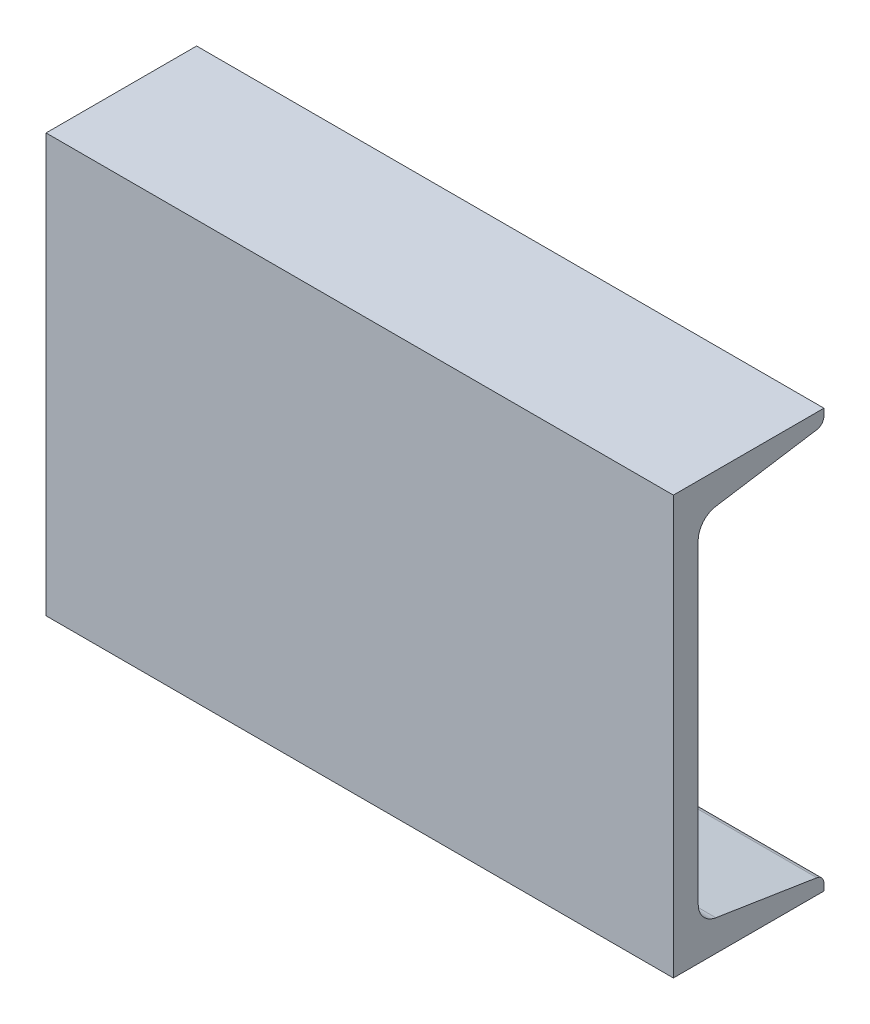
ISO-10303-21;
HEADER;
FILE_DESCRIPTION(('STEP AP214'),'2;1');
FILE_NAME('part.step','',(''),(''),'','','');
FILE_SCHEMA(('AUTOMOTIVE_DESIGN { 1 0 10303 214 1 1 1 1 }'));
ENDSEC;
DATA;
#1=APPLICATION_CONTEXT('core data for automotive mechanical design processes');
#2=APPLICATION_PROTOCOL_DEFINITION('international standard','automotive_design',2000,#1);
#3=PRODUCT_CONTEXT('',#1,'mechanical');
#4=PRODUCT('Part','Part','',(#3));
#5=PRODUCT_RELATED_PRODUCT_CATEGORY('part','',(#4));
#6=PRODUCT_DEFINITION_FORMATION('','',#4);
#7=PRODUCT_DEFINITION_CONTEXT('part definition',#1,'design');
#8=PRODUCT_DEFINITION('design','',#6,#7);
#9=PRODUCT_DEFINITION_SHAPE('','',#8);
#10=(LENGTH_UNIT() NAMED_UNIT(*) SI_UNIT(.MILLI.,.METRE.));
#11=(NAMED_UNIT(*) PLANE_ANGLE_UNIT() SI_UNIT($,.RADIAN.));
#12=(NAMED_UNIT(*) SI_UNIT($,.STERADIAN.) SOLID_ANGLE_UNIT());
#13=UNCERTAINTY_MEASURE_WITH_UNIT(LENGTH_MEASURE(1.E-05),#10,'distance_accuracy_value','');
#14=(GEOMETRIC_REPRESENTATION_CONTEXT(3) GLOBAL_UNCERTAINTY_ASSIGNED_CONTEXT((#13)) GLOBAL_UNIT_ASSIGNED_CONTEXT((#10,
#11,#12)) REPRESENTATION_CONTEXT('',''));
#15=CARTESIAN_POINT('',(0.,0.,0.));
#16=DIRECTION('',(0.,0.,1.));
#17=DIRECTION('',(1.,0.,0.));
#18=AXIS2_PLACEMENT_3D('',#15,#16,#17);
#19=CARTESIAN_POINT('',(114.3,-76.2,25.3365));
#20=DIRECTION('',(0.,1.,0.));
#21=DIRECTION('',(0.,0.,1.));
#22=AXIS2_PLACEMENT_3D('',#19,#20,#21);
#23=PLANE('',#22);
#24=DIRECTION('',(0.,0.,-1.));
#25=VECTOR('',#24,1.);
#26=CARTESIAN_POINT('',(-114.3,-76.2,25.3365));
#27=LINE('',#26,#25);
#28=CARTESIAN_POINT('',(-114.3,-76.2,25.3365));
#29=VERTEX_POINT('',#28);
#30=CARTESIAN_POINT('',(-114.3,-76.2,-29.5275));
#31=VERTEX_POINT('',#30);
#32=EDGE_CURVE('E154',#29,#31,#27,.T.);
#33=ORIENTED_EDGE('',*,*,#32,.T.);
#34=DIRECTION('',(-1.,0.,0.));
#35=VECTOR('',#34,1.);
#36=CARTESIAN_POINT('',(114.3,-76.2,-29.5275));
#37=LINE('',#36,#35);
#38=CARTESIAN_POINT('',(114.3,-76.2,-29.5275));
#39=VERTEX_POINT('',#38);
#40=EDGE_CURVE('E11',#39,#31,#37,.T.);
#41=ORIENTED_EDGE('',*,*,#40,.F.);
#42=DIRECTION('',(0.,0.,-1.));
#43=VECTOR('',#42,1.);
#44=CARTESIAN_POINT('',(114.3,-76.2,25.3365));
#45=LINE('',#44,#43);
#46=CARTESIAN_POINT('',(114.3,-76.2,25.3365));
#47=VERTEX_POINT('',#46);
#48=EDGE_CURVE('E176',#47,#39,#45,.T.);
#49=ORIENTED_EDGE('',*,*,#48,.F.);
#50=DIRECTION('',(-1.,0.,0.));
#51=VECTOR('',#50,1.);
#52=CARTESIAN_POINT('',(114.3,-76.2,25.3365));
#53=LINE('',#52,#51);
#54=EDGE_CURVE('E150',#47,#29,#53,.T.);
#55=ORIENTED_EDGE('',*,*,#54,.T.);
#56=EDGE_LOOP('',(#33,#41,#49,#55));
#57=FACE_BOUND('',#56,.T.);
#58=ADVANCED_FACE('F34',(#57),#23,.F.);
#59=CARTESIAN_POINT('',(114.3,-76.2,-29.5275));
#60=DIRECTION('',(0.,0.,1.));
#61=DIRECTION('',(0.,-1.,0.));
#62=AXIS2_PLACEMENT_3D('',#59,#60,#61);
#63=PLANE('',#62);
#64=DIRECTION('',(0.,1.,0.));
#65=VECTOR('',#64,1.);
#66=CARTESIAN_POINT('',(-114.3,-76.2,-29.5275));
#67=LINE('',#66,#65);
#68=CARTESIAN_POINT('',(-114.3,-73.7107446530364,-29.5275));
#69=VERTEX_POINT('',#68);
#70=EDGE_CURVE('E157',#31,#69,#67,.T.);
#71=ORIENTED_EDGE('',*,*,#70,.T.);
#72=DIRECTION('',(-1.,0.,0.));
#73=VECTOR('',#72,1.);
#74=CARTESIAN_POINT('',(114.3,-73.7107446530364,-29.5275));
#75=LINE('',#74,#73);
#76=CARTESIAN_POINT('',(114.3,-73.7107446530364,-29.5275));
#77=VERTEX_POINT('',#76);
#78=EDGE_CURVE('E42',#77,#69,#75,.T.);
#79=ORIENTED_EDGE('',*,*,#78,.F.);
#80=DIRECTION('',(0.,1.,0.));
#81=VECTOR('',#80,1.);
#82=CARTESIAN_POINT('',(114.3,-76.2,-29.5275));
#83=LINE('',#82,#81);
#84=EDGE_CURVE('E105',#39,#77,#83,.T.);
#85=ORIENTED_EDGE('',*,*,#84,.F.);
#86=ORIENTED_EDGE('',*,*,#40,.T.);
#87=EDGE_LOOP('',(#71,#79,#85,#86));
#88=FACE_BOUND('',#87,.T.);
#89=ADVANCED_FACE('F254',(#88),#63,.F.);
#90=CARTESIAN_POINT('',(114.3,-73.7107446530364,-26.4795));
#91=DIRECTION('',(-1.,0.,0.));
#92=DIRECTION('',(0.,0.,1.));
#93=AXIS2_PLACEMENT_3D('',#90,#91,#92);
#94=CYLINDRICAL_SURFACE('',#93,3.048);
#95=CARTESIAN_POINT('',(-114.3,-73.7107446530364,-26.4795));
#96=DIRECTION('',(1.,0.,0.));
#97=DIRECTION('',(0.,0.,-1.));
#98=AXIS2_PLACEMENT_3D('',#95,#96,#97);
#99=CIRCLE('',#98,3.048);
#100=CARTESIAN_POINT('',(-114.3,-70.6996432175585,-26.9523341625381));
#101=VERTEX_POINT('',#100);
#102=EDGE_CURVE('E159',#69,#101,#99,.T.);
#103=ORIENTED_EDGE('',*,*,#102,.T.);
#104=DIRECTION('',(-1.,0.,0.));
#105=VECTOR('',#104,1.);
#106=CARTESIAN_POINT('',(114.3,-70.6996432175585,-26.9523341625381));
#107=LINE('',#106,#105);
#108=CARTESIAN_POINT('',(114.3,-70.6996432175585,-26.9523341625381));
#109=VERTEX_POINT('',#108);
#110=EDGE_CURVE('E195',#109,#101,#107,.T.);
#111=ORIENTED_EDGE('',*,*,#110,.F.);
#112=CARTESIAN_POINT('',(114.3,-73.7107446530364,-26.4795));
#113=DIRECTION('',(1.,0.,0.));
#114=DIRECTION('',(0.,0.,-1.));
#115=AXIS2_PLACEMENT_3D('',#112,#113,#114);
#116=CIRCLE('',#115,3.048);
#117=EDGE_CURVE('E203',#77,#109,#116,.T.);
#118=ORIENTED_EDGE('',*,*,#117,.F.);
#119=ORIENTED_EDGE('',*,*,#78,.T.);
#120=EDGE_LOOP('',(#103,#111,#118,#119));
#121=FACE_BOUND('',#120,.T.);
#122=ADVANCED_FACE('F201',(#121),#94,.T.);
#123=CARTESIAN_POINT('',(114.3,-64.9195903373888,9.856185406345));
#124=DIRECTION('',(0.,-0.987894171744713,0.155129318417984));
#125=DIRECTION('',(0.,-0.155129318417984,-0.987894171744713));
#126=AXIS2_PLACEMENT_3D('',#123,#124,#125);
#127=PLANE('',#126);
#128=DIRECTION('',(0.,0.155129318417984,0.987894171744713));
#129=VECTOR('',#128,1.);
#130=CARTESIAN_POINT('',(-114.3,-64.9195903373888,9.856185406345));
#131=LINE('',#130,#129);
#132=CARTESIAN_POINT('',(-114.3,-64.9195903373888,9.856185406345));
#133=VERTEX_POINT('',#132);
#134=EDGE_CURVE('E161',#101,#133,#131,.T.);
#135=ORIENTED_EDGE('',*,*,#134,.T.);
#136=DIRECTION('',(-1.,0.,0.));
#137=VECTOR('',#136,1.);
#138=CARTESIAN_POINT('',(114.3,-64.9195903373888,9.856185406345));
#139=LINE('',#138,#137);
#140=CARTESIAN_POINT('',(114.3,-64.9195903373888,9.856185406345));
#141=VERTEX_POINT('',#140);
#142=EDGE_CURVE('E192',#141,#133,#139,.T.);
#143=ORIENTED_EDGE('',*,*,#142,.F.);
#144=DIRECTION('',(0.,0.155129318417984,0.987894171744713));
#145=VECTOR('',#144,1.);
#146=CARTESIAN_POINT('',(114.3,-64.9195903373888,9.856185406345));
#147=LINE('',#146,#145);
#148=EDGE_CURVE('E221',#109,#141,#147,.T.);
#149=ORIENTED_EDGE('',*,*,#148,.F.);
#150=ORIENTED_EDGE('',*,*,#110,.T.);
#151=EDGE_LOOP('',(#135,#143,#149,#150));
#152=FACE_BOUND('',#151,.T.);
#153=ADVANCED_FACE('F212',(#152),#127,.F.);
#154=CARTESIAN_POINT('',(114.3,-57.3918367486941,8.67409999999999));
#155=DIRECTION('',(-1.,0.,0.));
#156=DIRECTION('',(0.,0.,1.));
#157=AXIS2_PLACEMENT_3D('',#154,#155,#156);
#158=CYLINDRICAL_SURFACE('',#157,7.62000000000001);
#159=CARTESIAN_POINT('',(-114.3,-57.3918367486941,8.67409999999999));
#160=DIRECTION('',(-1.,0.,0.));
#161=DIRECTION('',(0.,0.,-1.));
#162=AXIS2_PLACEMENT_3D('',#159,#160,#161);
#163=CIRCLE('',#162,7.62000000000001);
#164=CARTESIAN_POINT('',(-114.3,-57.3918367486941,16.2941));
#165=VERTEX_POINT('',#164);
#166=EDGE_CURVE('E163',#133,#165,#163,.T.);
#167=ORIENTED_EDGE('',*,*,#166,.T.);
#168=DIRECTION('',(-1.,0.,0.));
#169=VECTOR('',#168,1.);
#170=CARTESIAN_POINT('',(114.3,-57.3918367486941,16.2941));
#171=LINE('',#170,#169);
#172=CARTESIAN_POINT('',(114.3,-57.3918367486941,16.2941));
#173=VERTEX_POINT('',#172);
#174=EDGE_CURVE('E189',#173,#165,#171,.T.);
#175=ORIENTED_EDGE('',*,*,#174,.F.);
#176=CARTESIAN_POINT('',(114.3,-57.3918367486941,8.67409999999999));
#177=DIRECTION('',(-1.,0.,0.));
#178=DIRECTION('',(0.,0.,-1.));
#179=AXIS2_PLACEMENT_3D('',#176,#177,#178);
#180=CIRCLE('',#179,7.62000000000001);
#181=EDGE_CURVE('E218',#141,#173,#180,.T.);
#182=ORIENTED_EDGE('',*,*,#181,.F.);
#183=ORIENTED_EDGE('',*,*,#142,.T.);
#184=EDGE_LOOP('',(#167,#175,#182,#183));
#185=FACE_BOUND('',#184,.T.);
#186=ADVANCED_FACE('F216',(#185),#158,.F.);
#187=CARTESIAN_POINT('',(114.3,57.3918367486941,16.2941));
#188=DIRECTION('',(0.,0.,1.));
#189=DIRECTION('',(0.,-1.,0.));
#190=AXIS2_PLACEMENT_3D('',#187,#188,#189);
#191=PLANE('',#190);
#192=DIRECTION('',(0.,1.,0.));
#193=VECTOR('',#192,1.);
#194=CARTESIAN_POINT('',(-114.3,57.3918367486941,16.2941));
#195=LINE('',#194,#193);
#196=CARTESIAN_POINT('',(-114.3,57.3918367486941,16.2941));
#197=VERTEX_POINT('',#196);
#198=EDGE_CURVE('E165',#165,#197,#195,.T.);
#199=ORIENTED_EDGE('',*,*,#198,.T.);
#200=DIRECTION('',(-1.,0.,0.));
#201=VECTOR('',#200,1.);
#202=CARTESIAN_POINT('',(114.3,57.3918367486941,16.2941));
#203=LINE('',#202,#201);
#204=CARTESIAN_POINT('',(114.3,57.3918367486941,16.2941));
#205=VERTEX_POINT('',#204);
#206=EDGE_CURVE('E186',#205,#197,#203,.T.);
#207=ORIENTED_EDGE('',*,*,#206,.F.);
#208=DIRECTION('',(0.,1.,0.));
#209=VECTOR('',#208,1.);
#210=CARTESIAN_POINT('',(114.3,57.3918367486941,16.2941));
#211=LINE('',#210,#209);
#212=EDGE_CURVE('E220',#173,#205,#211,.T.);
#213=ORIENTED_EDGE('',*,*,#212,.F.);
#214=ORIENTED_EDGE('',*,*,#174,.T.);
#215=EDGE_LOOP('',(#199,#207,#213,#214));
#216=FACE_BOUND('',#215,.T.);
#217=ADVANCED_FACE('F267',(#216),#191,.F.);
#218=CARTESIAN_POINT('',(114.3,57.3918367486941,8.6741));
#219=DIRECTION('',(-1.,0.,0.));
#220=DIRECTION('',(0.,0.,1.));
#221=AXIS2_PLACEMENT_3D('',#218,#219,#220);
#222=CYLINDRICAL_SURFACE('',#221,7.62);
#223=CARTESIAN_POINT('',(-114.3,57.3918367486941,8.6741));
#224=DIRECTION('',(-1.,0.,0.));
#225=DIRECTION('',(0.,0.,1.));
#226=AXIS2_PLACEMENT_3D('',#223,#224,#225);
#227=CIRCLE('',#226,7.62);
#228=CARTESIAN_POINT('',(-114.3,64.9195903373888,9.85618540634502));
#229=VERTEX_POINT('',#228);
#230=EDGE_CURVE('E167',#197,#229,#227,.T.);
#231=ORIENTED_EDGE('',*,*,#230,.T.);
#232=DIRECTION('',(-1.,0.,0.));
#233=VECTOR('',#232,1.);
#234=CARTESIAN_POINT('',(114.3,64.9195903373888,9.85618540634502));
#235=LINE('',#234,#233);
#236=CARTESIAN_POINT('',(114.3,64.9195903373888,9.85618540634502));
#237=VERTEX_POINT('',#236);
#238=EDGE_CURVE('E183',#237,#229,#235,.T.);
#239=ORIENTED_EDGE('',*,*,#238,.F.);
#240=CARTESIAN_POINT('',(114.3,57.3918367486941,8.6741));
#241=DIRECTION('',(-1.,0.,0.));
#242=DIRECTION('',(0.,0.,1.));
#243=AXIS2_PLACEMENT_3D('',#240,#241,#242);
#244=CIRCLE('',#243,7.62);
#245=EDGE_CURVE('E223',#205,#237,#244,.T.);
#246=ORIENTED_EDGE('',*,*,#245,.F.);
#247=ORIENTED_EDGE('',*,*,#206,.T.);
#248=EDGE_LOOP('',(#231,#239,#246,#247));
#249=FACE_BOUND('',#248,.T.);
#250=ADVANCED_FACE('F270',(#249),#222,.F.);
#251=CARTESIAN_POINT('',(114.3,64.9195903373888,9.85618540634502));
#252=DIRECTION('',(0.,0.987894171744713,0.155129318417984));
#253=DIRECTION('',(0.,-0.155129318417984,0.987894171744713));
#254=AXIS2_PLACEMENT_3D('',#251,#252,#253);
#255=PLANE('',#254);
#256=DIRECTION('',(0.,0.155129318417984,-0.987894171744713));
#257=VECTOR('',#256,1.);
#258=CARTESIAN_POINT('',(-114.3,64.9195903373888,9.85618540634502));
#259=LINE('',#258,#257);
#260=CARTESIAN_POINT('',(-114.3,70.6996432175585,-26.952334162538));
#261=VERTEX_POINT('',#260);
#262=EDGE_CURVE('E169',#229,#261,#259,.T.);
#263=ORIENTED_EDGE('',*,*,#262,.T.);
#264=DIRECTION('',(-1.,0.,0.));
#265=VECTOR('',#264,1.);
#266=CARTESIAN_POINT('',(114.3,70.6996432175585,-26.952334162538));
#267=LINE('',#266,#265);
#268=CARTESIAN_POINT('',(114.3,70.6996432175585,-26.952334162538));
#269=VERTEX_POINT('',#268);
#270=EDGE_CURVE('E180',#269,#261,#267,.T.);
#271=ORIENTED_EDGE('',*,*,#270,.F.);
#272=DIRECTION('',(0.,0.155129318417984,-0.987894171744713));
#273=VECTOR('',#272,1.);
#274=CARTESIAN_POINT('',(114.3,64.9195903373888,9.85618540634502));
#275=LINE('',#274,#273);
#276=EDGE_CURVE('E229',#237,#269,#275,.T.);
#277=ORIENTED_EDGE('',*,*,#276,.F.);
#278=ORIENTED_EDGE('',*,*,#238,.T.);
#279=EDGE_LOOP('',(#263,#271,#277,#278));
#280=FACE_BOUND('',#279,.T.);
#281=ADVANCED_FACE('F235',(#280),#255,.F.);
#282=CARTESIAN_POINT('',(114.3,73.7107446530364,-26.4795));
#283=DIRECTION('',(-1.,0.,0.));
#284=DIRECTION('',(0.,0.,1.));
#285=AXIS2_PLACEMENT_3D('',#282,#283,#284);
#286=CYLINDRICAL_SURFACE('',#285,3.04800000000001);
#287=CARTESIAN_POINT('',(-114.3,73.7107446530364,-26.4795));
#288=DIRECTION('',(1.,0.,0.));
#289=DIRECTION('',(0.,0.,1.));
#290=AXIS2_PLACEMENT_3D('',#287,#288,#289);
#291=CIRCLE('',#290,3.04800000000001);
#292=CARTESIAN_POINT('',(-114.3,73.7107446530364,-29.5275));
#293=VERTEX_POINT('',#292);
#294=EDGE_CURVE('E171',#261,#293,#291,.T.);
#295=ORIENTED_EDGE('',*,*,#294,.T.);
#296=DIRECTION('',(-1.,0.,0.));
#297=VECTOR('',#296,1.);
#298=CARTESIAN_POINT('',(114.3,73.7107446530364,-29.5275));
#299=LINE('',#298,#297);
#300=CARTESIAN_POINT('',(114.3,73.7107446530364,-29.5275));
#301=VERTEX_POINT('',#300);
#302=EDGE_CURVE('E145',#301,#293,#299,.T.);
#303=ORIENTED_EDGE('',*,*,#302,.F.);
#304=CARTESIAN_POINT('',(114.3,73.7107446530364,-26.4795));
#305=DIRECTION('',(1.,0.,0.));
#306=DIRECTION('',(0.,0.,1.));
#307=AXIS2_PLACEMENT_3D('',#304,#305,#306);
#308=CIRCLE('',#307,3.04800000000001);
#309=EDGE_CURVE('E136',#269,#301,#308,.T.);
#310=ORIENTED_EDGE('',*,*,#309,.F.);
#311=ORIENTED_EDGE('',*,*,#270,.T.);
#312=EDGE_LOOP('',(#295,#303,#310,#311));
#313=FACE_BOUND('',#312,.T.);
#314=ADVANCED_FACE('F239',(#313),#286,.T.);
#315=CARTESIAN_POINT('',(114.3,76.2,-29.5275));
#316=DIRECTION('',(0.,0.,1.));
#317=DIRECTION('',(0.,-1.,0.));
#318=AXIS2_PLACEMENT_3D('',#315,#316,#317);
#319=PLANE('',#318);
#320=DIRECTION('',(0.,1.,0.));
#321=VECTOR('',#320,1.);
#322=CARTESIAN_POINT('',(-114.3,76.2,-29.5275));
#323=LINE('',#322,#321);
#324=CARTESIAN_POINT('',(-114.3,76.2,-29.5275));
#325=VERTEX_POINT('',#324);
#326=EDGE_CURVE('E144',#293,#325,#323,.T.);
#327=ORIENTED_EDGE('',*,*,#326,.T.);
#328=DIRECTION('',(-1.,0.,0.));
#329=VECTOR('',#328,1.);
#330=CARTESIAN_POINT('',(114.3,76.2,-29.5275));
#331=LINE('',#330,#329);
#332=CARTESIAN_POINT('',(114.3,76.2,-29.5275));
#333=VERTEX_POINT('',#332);
#334=EDGE_CURVE('E141',#333,#325,#331,.T.);
#335=ORIENTED_EDGE('',*,*,#334,.F.);
#336=DIRECTION('',(0.,1.,0.));
#337=VECTOR('',#336,1.);
#338=CARTESIAN_POINT('',(114.3,76.2,-29.5275));
#339=LINE('',#338,#337);
#340=EDGE_CURVE('E130',#301,#333,#339,.T.);
#341=ORIENTED_EDGE('',*,*,#340,.F.);
#342=ORIENTED_EDGE('',*,*,#302,.T.);
#343=EDGE_LOOP('',(#327,#335,#341,#342));
#344=FACE_BOUND('',#343,.T.);
#345=ADVANCED_FACE('F142',(#344),#319,.F.);
#346=CARTESIAN_POINT('',(114.3,76.2,25.3365));
#347=DIRECTION('',(0.,-1.,0.));
#348=DIRECTION('',(0.,0.,-1.));
#349=AXIS2_PLACEMENT_3D('',#346,#347,#348);
#350=PLANE('',#349);
#351=DIRECTION('',(0.,0.,1.));
#352=VECTOR('',#351,1.);
#353=CARTESIAN_POINT('',(-114.3,76.2,25.3365));
#354=LINE('',#353,#352);
#355=CARTESIAN_POINT('',(-114.3,76.2,25.3365));
#356=VERTEX_POINT('',#355);
#357=EDGE_CURVE('E91',#325,#356,#354,.T.);
#358=ORIENTED_EDGE('',*,*,#357,.T.);
#359=DIRECTION('',(-1.,0.,0.));
#360=VECTOR('',#359,1.);
#361=CARTESIAN_POINT('',(114.3,76.2,25.3365));
#362=LINE('',#361,#360);
#363=CARTESIAN_POINT('',(114.3,76.2,25.3365));
#364=VERTEX_POINT('',#363);
#365=EDGE_CURVE('E146',#364,#356,#362,.T.);
#366=ORIENTED_EDGE('',*,*,#365,.F.);
#367=DIRECTION('',(0.,0.,1.));
#368=VECTOR('',#367,1.);
#369=CARTESIAN_POINT('',(114.3,76.2,25.3365));
#370=LINE('',#369,#368);
#371=EDGE_CURVE('E134',#333,#364,#370,.T.);
#372=ORIENTED_EDGE('',*,*,#371,.F.);
#373=ORIENTED_EDGE('',*,*,#334,.T.);
#374=EDGE_LOOP('',(#358,#366,#372,#373));
#375=FACE_BOUND('',#374,.T.);
#376=ADVANCED_FACE('F148',(#375),#350,.F.);
#377=CARTESIAN_POINT('',(114.3,-76.2,25.3365));
#378=DIRECTION('',(0.,0.,-1.));
#379=DIRECTION('',(-1.,0.,0.));
#380=AXIS2_PLACEMENT_3D('',#377,#378,#379);
#381=PLANE('',#380);
#382=DIRECTION('',(0.,-1.,0.));
#383=VECTOR('',#382,1.);
#384=CARTESIAN_POINT('',(-114.3,-76.2,25.3365));
#385=LINE('',#384,#383);
#386=EDGE_CURVE('E97',#356,#29,#385,.T.);
#387=ORIENTED_EDGE('',*,*,#386,.T.);
#388=ORIENTED_EDGE('',*,*,#54,.F.);
#389=DIRECTION('',(0.,-1.,0.));
#390=VECTOR('',#389,1.);
#391=CARTESIAN_POINT('',(114.3,-76.2,25.3365));
#392=LINE('',#391,#390);
#393=EDGE_CURVE('E50',#364,#47,#392,.T.);
#394=ORIENTED_EDGE('',*,*,#393,.F.);
#395=ORIENTED_EDGE('',*,*,#365,.T.);
#396=EDGE_LOOP('',(#387,#388,#394,#395));
#397=FACE_BOUND('',#396,.T.);
#398=ADVANCED_FACE('F243',(#397),#381,.F.);
#399=CARTESIAN_POINT('',(114.3,-73.7107446530364,-26.4795));
#400=DIRECTION('',(1.,0.,0.));
#401=DIRECTION('',(0.,0.,-1.));
#402=AXIS2_PLACEMENT_3D('',#399,#400,#401);
#403=PLANE('',#402);
#404=ORIENTED_EDGE('',*,*,#48,.T.);
#405=ORIENTED_EDGE('',*,*,#84,.T.);
#406=ORIENTED_EDGE('',*,*,#117,.T.);
#407=ORIENTED_EDGE('',*,*,#148,.T.);
#408=ORIENTED_EDGE('',*,*,#181,.T.);
#409=ORIENTED_EDGE('',*,*,#212,.T.);
#410=ORIENTED_EDGE('',*,*,#245,.T.);
#411=ORIENTED_EDGE('',*,*,#276,.T.);
#412=ORIENTED_EDGE('',*,*,#309,.T.);
#413=ORIENTED_EDGE('',*,*,#340,.T.);
#414=ORIENTED_EDGE('',*,*,#371,.T.);
#415=ORIENTED_EDGE('',*,*,#393,.T.);
#416=EDGE_LOOP('',(#404,#405,#406,#407,#408,#409,#410,#411,#412,#413,#414,#415));
#417=FACE_BOUND('',#416,.T.);
#418=ADVANCED_FACE('F132',(#417),#403,.T.);
#419=CARTESIAN_POINT('',(-114.3,-73.7107446530364,-26.4795));
#420=DIRECTION('',(1.,0.,0.));
#421=DIRECTION('',(0.,0.,-1.));
#422=AXIS2_PLACEMENT_3D('',#419,#420,#421);
#423=PLANE('',#422);
#424=ORIENTED_EDGE('',*,*,#32,.F.);
#425=ORIENTED_EDGE('',*,*,#386,.F.);
#426=ORIENTED_EDGE('',*,*,#357,.F.);
#427=ORIENTED_EDGE('',*,*,#326,.F.);
#428=ORIENTED_EDGE('',*,*,#294,.F.);
#429=ORIENTED_EDGE('',*,*,#262,.F.);
#430=ORIENTED_EDGE('',*,*,#230,.F.);
#431=ORIENTED_EDGE('',*,*,#198,.F.);
#432=ORIENTED_EDGE('',*,*,#166,.F.);
#433=ORIENTED_EDGE('',*,*,#134,.F.);
#434=ORIENTED_EDGE('',*,*,#102,.F.);
#435=ORIENTED_EDGE('',*,*,#70,.F.);
#436=EDGE_LOOP('',(#424,#425,#426,#427,#428,#429,#430,#431,#432,#433,#434,#435));
#437=FACE_BOUND('',#436,.T.);
#438=ADVANCED_FACE('F207',(#437),#423,.F.);
#439=CLOSED_SHELL('',(#58,#89,#122,#153,#186,#217,#250,#281,#314,#345,#376,#398,#418,#438));
#440=MANIFOLD_SOLID_BREP('B2',#439);
#441=ADVANCED_BREP_SHAPE_REPRESENTATION('',(#18,#440),#14);
#442=SHAPE_DEFINITION_REPRESENTATION(#9,#441);
ENDSEC;
END-ISO-10303-21;
